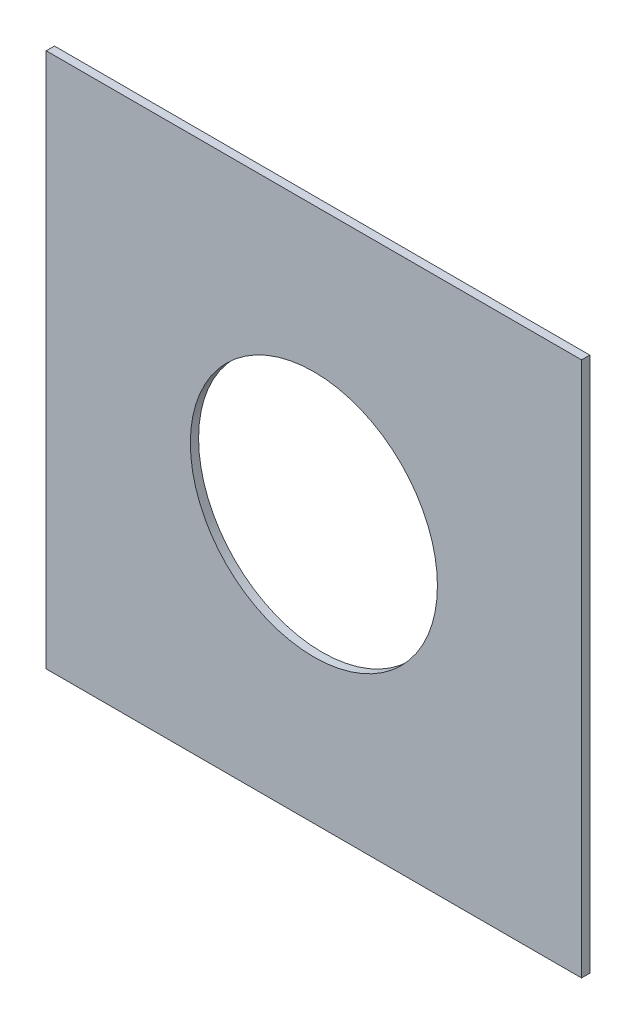
ISO-10303-21;
HEADER;
FILE_DESCRIPTION(('STEP AP214'),'2;1');
FILE_NAME('part.step','',(''),(''),'','','');
FILE_SCHEMA(('AUTOMOTIVE_DESIGN { 1 0 10303 214 1 1 1 1 }'));
ENDSEC;
DATA;
#1=APPLICATION_CONTEXT('core data for automotive mechanical design processes');
#2=APPLICATION_PROTOCOL_DEFINITION('international standard','automotive_design',2000,#1);
#3=PRODUCT_CONTEXT('',#1,'mechanical');
#4=PRODUCT('Part','Part','',(#3));
#5=PRODUCT_RELATED_PRODUCT_CATEGORY('part','',(#4));
#6=PRODUCT_DEFINITION_FORMATION('','',#4);
#7=PRODUCT_DEFINITION_CONTEXT('part definition',#1,'design');
#8=PRODUCT_DEFINITION('design','',#6,#7);
#9=PRODUCT_DEFINITION_SHAPE('','',#8);
#10=(LENGTH_UNIT() NAMED_UNIT(*) SI_UNIT(.MILLI.,.METRE.));
#11=(NAMED_UNIT(*) PLANE_ANGLE_UNIT() SI_UNIT($,.RADIAN.));
#12=(NAMED_UNIT(*) SI_UNIT($,.STERADIAN.) SOLID_ANGLE_UNIT());
#13=UNCERTAINTY_MEASURE_WITH_UNIT(LENGTH_MEASURE(1.E-05),#10,'distance_accuracy_value','');
#14=(GEOMETRIC_REPRESENTATION_CONTEXT(3) GLOBAL_UNCERTAINTY_ASSIGNED_CONTEXT((#13)) GLOBAL_UNIT_ASSIGNED_CONTEXT((#10,
#11,#12)) REPRESENTATION_CONTEXT('',''));
#15=CARTESIAN_POINT('',(0.,0.,0.));
#16=DIRECTION('',(0.,0.,1.));
#17=DIRECTION('',(1.,0.,0.));
#18=AXIS2_PLACEMENT_3D('',#15,#16,#17);
#19=CARTESIAN_POINT('',(3.025,-4.851,-6.999));
#20=DIRECTION('',(-1.,0.,0.));
#21=DIRECTION('',(0.,1.,0.));
#22=AXIS2_PLACEMENT_3D('',#19,#20,#21);
#23=PLANE('',#22);
#24=DIRECTION('',(0.,0.,1.));
#25=VECTOR('',#24,1.);
#26=CARTESIAN_POINT('',(3.025,-3.55,-7.01));
#27=LINE('',#26,#25);
#28=CARTESIAN_POINT('',(3.025,-3.55,-7.02));
#29=VERTEX_POINT('',#28);
#30=CARTESIAN_POINT('',(3.025,-3.55,-7.));
#31=VERTEX_POINT('',#30);
#32=EDGE_CURVE('E55',#29,#31,#27,.T.);
#33=ORIENTED_EDGE('',*,*,#32,.F.);
#34=DIRECTION('',(0.,1.,0.));
#35=VECTOR('',#34,1.);
#36=CARTESIAN_POINT('',(3.025,-4.2,-7.02));
#37=LINE('',#36,#35);
#38=CARTESIAN_POINT('',(3.025,-4.85,-7.02));
#39=VERTEX_POINT('',#38);
#40=EDGE_CURVE('E93',#39,#29,#37,.T.);
#41=ORIENTED_EDGE('',*,*,#40,.F.);
#42=DIRECTION('',(0.,0.,1.));
#43=VECTOR('',#42,1.);
#44=CARTESIAN_POINT('',(3.025,-4.85,-7.01));
#45=LINE('',#44,#43);
#46=CARTESIAN_POINT('',(3.025,-4.85,-7.));
#47=VERTEX_POINT('',#46);
#48=EDGE_CURVE('E35',#39,#47,#45,.T.);
#49=ORIENTED_EDGE('',*,*,#48,.T.);
#50=DIRECTION('',(0.,-1.,0.));
#51=VECTOR('',#50,1.);
#52=CARTESIAN_POINT('',(3.025,-4.2,-7.));
#53=LINE('',#52,#51);
#54=EDGE_CURVE('E76',#31,#47,#53,.T.);
#55=ORIENTED_EDGE('',*,*,#54,.F.);
#56=EDGE_LOOP('',(#33,#41,#49,#55));
#57=FACE_BOUND('',#56,.T.);
#58=ADVANCED_FACE('F17',(#57),#23,.T.);
#59=CARTESIAN_POINT('',(3.024,-3.55,-6.999));
#60=DIRECTION('',(0.,1.,0.));
#61=DIRECTION('',(1.,0.,0.));
#62=AXIS2_PLACEMENT_3D('',#59,#60,#61);
#63=PLANE('',#62);
#64=DIRECTION('',(0.,0.,1.));
#65=VECTOR('',#64,1.);
#66=CARTESIAN_POINT('',(4.325,-3.55,-7.01));
#67=LINE('',#66,#65);
#68=CARTESIAN_POINT('',(4.325,-3.55,-7.02));
#69=VERTEX_POINT('',#68);
#70=CARTESIAN_POINT('',(4.325,-3.55,-7.));
#71=VERTEX_POINT('',#70);
#72=EDGE_CURVE('E61',#69,#71,#67,.T.);
#73=ORIENTED_EDGE('',*,*,#72,.F.);
#74=DIRECTION('',(1.,0.,0.));
#75=VECTOR('',#74,1.);
#76=CARTESIAN_POINT('',(3.675,-3.55,-7.02));
#77=LINE('',#76,#75);
#78=EDGE_CURVE('E89',#29,#69,#77,.T.);
#79=ORIENTED_EDGE('',*,*,#78,.F.);
#80=ORIENTED_EDGE('',*,*,#32,.T.);
#81=DIRECTION('',(-1.,0.,0.));
#82=VECTOR('',#81,1.);
#83=CARTESIAN_POINT('',(3.675,-3.55,-7.));
#84=LINE('',#83,#82);
#85=EDGE_CURVE('E72',#71,#31,#84,.T.);
#86=ORIENTED_EDGE('',*,*,#85,.F.);
#87=EDGE_LOOP('',(#73,#79,#80,#86));
#88=FACE_BOUND('',#87,.T.);
#89=ADVANCED_FACE('F73',(#88),#63,.T.);
#90=CARTESIAN_POINT('',(4.325,-3.549,-6.999));
#91=DIRECTION('',(1.,0.,0.));
#92=DIRECTION('',(0.,-1.,0.));
#93=AXIS2_PLACEMENT_3D('',#90,#91,#92);
#94=PLANE('',#93);
#95=DIRECTION('',(0.,0.,-1.));
#96=VECTOR('',#95,1.);
#97=CARTESIAN_POINT('',(4.325,-4.85,-7.01));
#98=LINE('',#97,#96);
#99=CARTESIAN_POINT('',(4.325,-4.85,-7.));
#100=VERTEX_POINT('',#99);
#101=CARTESIAN_POINT('',(4.325,-4.85,-7.02));
#102=VERTEX_POINT('',#101);
#103=EDGE_CURVE('E69',#100,#102,#98,.T.);
#104=ORIENTED_EDGE('',*,*,#103,.T.);
#105=DIRECTION('',(0.,-1.,0.));
#106=VECTOR('',#105,1.);
#107=CARTESIAN_POINT('',(4.325,-4.2,-7.02));
#108=LINE('',#107,#106);
#109=EDGE_CURVE('E67',#69,#102,#108,.T.);
#110=ORIENTED_EDGE('',*,*,#109,.F.);
#111=ORIENTED_EDGE('',*,*,#72,.T.);
#112=DIRECTION('',(0.,1.,0.));
#113=VECTOR('',#112,1.);
#114=CARTESIAN_POINT('',(4.325,-4.2,-7.));
#115=LINE('',#114,#113);
#116=EDGE_CURVE('E64',#100,#71,#115,.T.);
#117=ORIENTED_EDGE('',*,*,#116,.F.);
#118=EDGE_LOOP('',(#104,#110,#111,#117));
#119=FACE_BOUND('',#118,.T.);
#120=ADVANCED_FACE('F62',(#119),#94,.T.);
#121=CARTESIAN_POINT('',(3.675,-4.2,-7.));
#122=DIRECTION('',(0.,0.,-1.));
#123=DIRECTION('',(-1.,0.,0.));
#124=AXIS2_PLACEMENT_3D('',#121,#122,#123);
#125=CYLINDRICAL_SURFACE('',#124,0.3);
#126=CARTESIAN_POINT('',(3.675,-4.2,-7.02));
#127=DIRECTION('',(0.,0.,-1.));
#128=DIRECTION('',(-1.,0.,0.));
#129=AXIS2_PLACEMENT_3D('',#126,#127,#128);
#130=CIRCLE('',#129,0.3);
#131=CARTESIAN_POINT('',(3.375,-4.2,-7.02));
#132=VERTEX_POINT('',#131);
#133=EDGE_CURVE('E84',#132,#132,#130,.F.);
#134=ORIENTED_EDGE('',*,*,#133,.F.);
#135=EDGE_LOOP('',(#134));
#136=FACE_BOUND('',#135,.T.);
#137=CARTESIAN_POINT('',(3.675,-4.2,-7.));
#138=DIRECTION('',(0.,0.,-1.));
#139=DIRECTION('',(-1.,0.,0.));
#140=AXIS2_PLACEMENT_3D('',#137,#138,#139);
#141=CIRCLE('',#140,0.3);
#142=CARTESIAN_POINT('',(3.375,-4.2,-7.));
#143=VERTEX_POINT('',#142);
#144=EDGE_CURVE('E21',#143,#143,#141,.T.);
#145=ORIENTED_EDGE('',*,*,#144,.F.);
#146=EDGE_LOOP('',(#145));
#147=FACE_BOUND('',#146,.T.);
#148=ADVANCED_FACE('F101',(#136,#147),#125,.F.);
#149=CARTESIAN_POINT('',(4.326,-3.549,-7.));
#150=DIRECTION('',(0.,0.,1.));
#151=DIRECTION('',(-1.,0.,0.));
#152=AXIS2_PLACEMENT_3D('',#149,#150,#151);
#153=PLANE('',#152);
#154=ORIENTED_EDGE('',*,*,#144,.T.);
#155=EDGE_LOOP('',(#154));
#156=FACE_BOUND('',#155,.T.);
#157=ORIENTED_EDGE('',*,*,#54,.T.);
#158=DIRECTION('',(-1.,0.,0.));
#159=VECTOR('',#158,1.);
#160=CARTESIAN_POINT('',(3.675,-4.85,-7.));
#161=LINE('',#160,#159);
#162=EDGE_CURVE('E27',#100,#47,#161,.T.);
#163=ORIENTED_EDGE('',*,*,#162,.F.);
#164=ORIENTED_EDGE('',*,*,#116,.T.);
#165=ORIENTED_EDGE('',*,*,#85,.T.);
#166=EDGE_LOOP('',(#157,#163,#164,#165));
#167=FACE_BOUND('',#166,.T.);
#168=ADVANCED_FACE('F78',(#156,#167),#153,.T.);
#169=CARTESIAN_POINT('',(3.024,-3.549,-7.02));
#170=DIRECTION('',(0.,0.,-1.));
#171=DIRECTION('',(1.,0.,0.));
#172=AXIS2_PLACEMENT_3D('',#169,#170,#171);
#173=PLANE('',#172);
#174=ORIENTED_EDGE('',*,*,#133,.T.);
#175=EDGE_LOOP('',(#174));
#176=FACE_BOUND('',#175,.T.);
#177=ORIENTED_EDGE('',*,*,#78,.T.);
#178=ORIENTED_EDGE('',*,*,#109,.T.);
#179=DIRECTION('',(1.,0.,0.));
#180=VECTOR('',#179,1.);
#181=CARTESIAN_POINT('',(3.675,-4.85,-7.02));
#182=LINE('',#181,#180);
#183=EDGE_CURVE('E11',#39,#102,#182,.T.);
#184=ORIENTED_EDGE('',*,*,#183,.F.);
#185=ORIENTED_EDGE('',*,*,#40,.T.);
#186=EDGE_LOOP('',(#177,#178,#184,#185));
#187=FACE_BOUND('',#186,.T.);
#188=ADVANCED_FACE('F110',(#176,#187),#173,.T.);
#189=CARTESIAN_POINT('',(4.326,-4.85,-6.999));
#190=DIRECTION('',(0.,-1.,0.));
#191=DIRECTION('',(-1.,0.,0.));
#192=AXIS2_PLACEMENT_3D('',#189,#190,#191);
#193=PLANE('',#192);
#194=ORIENTED_EDGE('',*,*,#48,.F.);
#195=ORIENTED_EDGE('',*,*,#183,.T.);
#196=ORIENTED_EDGE('',*,*,#103,.F.);
#197=ORIENTED_EDGE('',*,*,#162,.T.);
#198=EDGE_LOOP('',(#194,#195,#196,#197));
#199=FACE_BOUND('',#198,.T.);
#200=ADVANCED_FACE('F19',(#199),#193,.T.);
#201=CLOSED_SHELL('',(#58,#89,#120,#148,#168,#188,#200));
#202=MANIFOLD_SOLID_BREP('B1',#201);
#203=ADVANCED_BREP_SHAPE_REPRESENTATION('',(#18,#202),#14);
#204=SHAPE_DEFINITION_REPRESENTATION(#9,#203);
ENDSEC;
END-ISO-10303-21;
